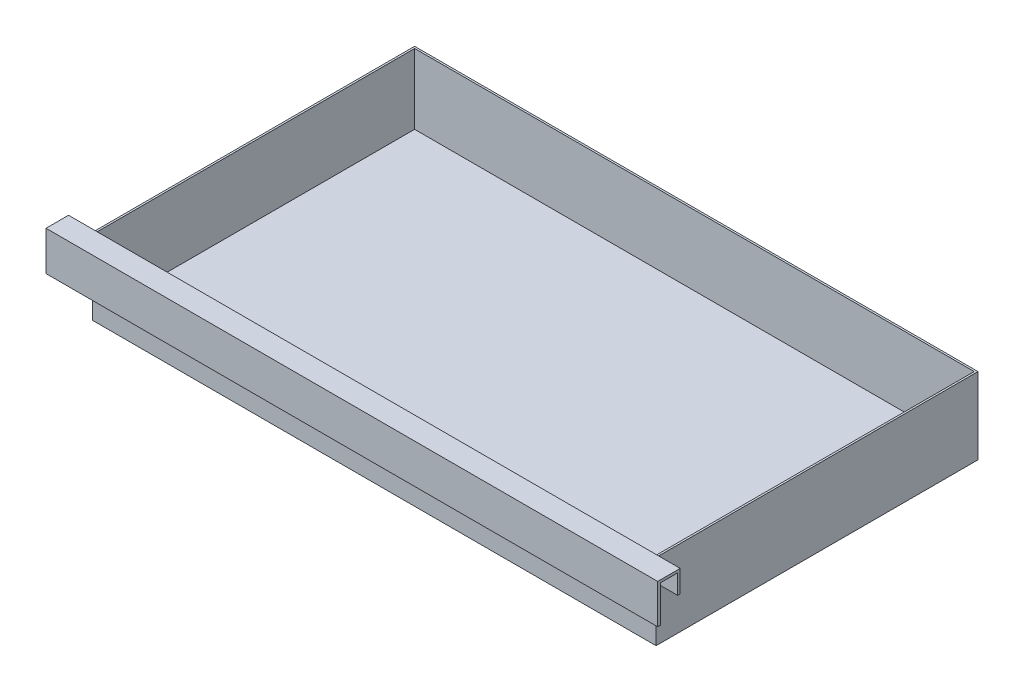
ISO-10303-21;
HEADER;
FILE_DESCRIPTION(('STEP AP214'),'2;1');
FILE_NAME('part.step','',(''),(''),'','','');
FILE_SCHEMA(('AUTOMOTIVE_DESIGN { 1 0 10303 214 1 1 1 1 }'));
ENDSEC;
DATA;
#1=APPLICATION_CONTEXT('core data for automotive mechanical design processes');
#2=APPLICATION_PROTOCOL_DEFINITION('international standard','automotive_design',2000,#1);
#3=PRODUCT_CONTEXT('',#1,'mechanical');
#4=PRODUCT('Part','Part','',(#3));
#5=PRODUCT_RELATED_PRODUCT_CATEGORY('part','',(#4));
#6=PRODUCT_DEFINITION_FORMATION('','',#4);
#7=PRODUCT_DEFINITION_CONTEXT('part definition',#1,'design');
#8=PRODUCT_DEFINITION('design','',#6,#7);
#9=PRODUCT_DEFINITION_SHAPE('','',#8);
#10=(LENGTH_UNIT() NAMED_UNIT(*) SI_UNIT(.MILLI.,.METRE.));
#11=(NAMED_UNIT(*) PLANE_ANGLE_UNIT() SI_UNIT($,.RADIAN.));
#12=(NAMED_UNIT(*) SI_UNIT($,.STERADIAN.) SOLID_ANGLE_UNIT());
#13=UNCERTAINTY_MEASURE_WITH_UNIT(LENGTH_MEASURE(1.E-05),#10,'distance_accuracy_value','');
#14=(GEOMETRIC_REPRESENTATION_CONTEXT(3) GLOBAL_UNCERTAINTY_ASSIGNED_CONTEXT((#13)) GLOBAL_UNIT_ASSIGNED_CONTEXT((#10,
#11,#12)) REPRESENTATION_CONTEXT('',''));
#15=CARTESIAN_POINT('',(0.,0.,0.));
#16=DIRECTION('',(0.,0.,1.));
#17=DIRECTION('',(1.,0.,0.));
#18=AXIS2_PLACEMENT_3D('',#15,#16,#17);
#19=CARTESIAN_POINT('',(0.,2.54,0.));
#20=DIRECTION('',(0.,0.,-1.));
#21=DIRECTION('',(-1.,0.,0.));
#22=AXIS2_PLACEMENT_3D('',#19,#20,#21);
#23=PLANE('',#22);
#24=DIRECTION('',(1.,0.,0.));
#25=VECTOR('',#24,1.);
#26=CARTESIAN_POINT('',(-120.65,22.4754146021905,0.));
#27=LINE('',#26,#25);
#28=CARTESIAN_POINT('',(-111.125,22.4754146021905,0.));
#29=VERTEX_POINT('',#28);
#30=CARTESIAN_POINT('',(111.125,22.4754146021905,0.));
#31=VERTEX_POINT('',#30);
#32=EDGE_CURVE('E11',#29,#31,#27,.T.);
#33=ORIENTED_EDGE('',*,*,#32,.F.);
#34=DIRECTION('',(0.,-1.,0.));
#35=VECTOR('',#34,1.);
#36=CARTESIAN_POINT('',(-111.125,2.54,0.));
#37=LINE('',#36,#35);
#38=CARTESIAN_POINT('',(-111.125,0.,0.));
#39=VERTEX_POINT('',#38);
#40=EDGE_CURVE('E292',#29,#39,#37,.T.);
#41=ORIENTED_EDGE('',*,*,#40,.T.);
#42=DIRECTION('',(1.,0.,0.));
#43=VECTOR('',#42,1.);
#44=CARTESIAN_POINT('',(0.,0.,0.));
#45=LINE('',#44,#43);
#46=CARTESIAN_POINT('',(111.125,0.,0.));
#47=VERTEX_POINT('',#46);
#48=EDGE_CURVE('E282',#39,#47,#45,.T.);
#49=ORIENTED_EDGE('',*,*,#48,.T.);
#50=DIRECTION('',(0.,-1.,0.));
#51=VECTOR('',#50,1.);
#52=CARTESIAN_POINT('',(111.125,2.54,0.));
#53=LINE('',#52,#51);
#54=EDGE_CURVE('E290',#31,#47,#53,.T.);
#55=ORIENTED_EDGE('',*,*,#54,.F.);
#56=EDGE_LOOP('',(#33,#41,#49,#55));
#57=FACE_BOUND('',#56,.T.);
#58=ADVANCED_FACE('F41',(#57),#23,.F.);
#59=CARTESIAN_POINT('',(0.,2.54,-127.));
#60=DIRECTION('',(0.,0.,1.));
#61=DIRECTION('',(1.,0.,0.));
#62=AXIS2_PLACEMENT_3D('',#59,#60,#61);
#63=PLANE('',#62);
#64=DIRECTION('',(-1.,0.,0.));
#65=VECTOR('',#64,1.);
#66=CARTESIAN_POINT('',(0.,0.,-127.));
#67=LINE('',#66,#65);
#68=CARTESIAN_POINT('',(111.125,0.,-127.));
#69=VERTEX_POINT('',#68);
#70=CARTESIAN_POINT('',(-111.125,0.,-127.));
#71=VERTEX_POINT('',#70);
#72=EDGE_CURVE('E276',#69,#71,#67,.T.);
#73=ORIENTED_EDGE('',*,*,#72,.T.);
#74=DIRECTION('',(0.,-1.,0.));
#75=VECTOR('',#74,1.);
#76=CARTESIAN_POINT('',(-111.125,2.54,-127.));
#77=LINE('',#76,#75);
#78=CARTESIAN_POINT('',(-111.125,30.1625,-127.));
#79=VERTEX_POINT('',#78);
#80=EDGE_CURVE('E45',#79,#71,#77,.T.);
#81=ORIENTED_EDGE('',*,*,#80,.F.);
#82=DIRECTION('',(-1.,0.,0.));
#83=VECTOR('',#82,1.);
#84=CARTESIAN_POINT('',(111.125,30.1625,-127.));
#85=LINE('',#84,#83);
#86=CARTESIAN_POINT('',(111.125,30.1625,-127.));
#87=VERTEX_POINT('',#86);
#88=EDGE_CURVE('E264',#87,#79,#85,.T.);
#89=ORIENTED_EDGE('',*,*,#88,.F.);
#90=DIRECTION('',(0.,-1.,0.));
#91=VECTOR('',#90,1.);
#92=CARTESIAN_POINT('',(111.125,2.54,-127.));
#93=LINE('',#92,#91);
#94=EDGE_CURVE('E287',#87,#69,#93,.T.);
#95=ORIENTED_EDGE('',*,*,#94,.T.);
#96=EDGE_LOOP('',(#73,#81,#89,#95));
#97=FACE_BOUND('',#96,.T.);
#98=ADVANCED_FACE('F43',(#97),#63,.F.);
#99=CARTESIAN_POINT('',(-111.125,2.54,0.));
#100=DIRECTION('',(1.,0.,0.));
#101=DIRECTION('',(0.,0.,-1.));
#102=AXIS2_PLACEMENT_3D('',#99,#100,#101);
#103=PLANE('',#102);
#104=DIRECTION('',(0.,0.,1.));
#105=VECTOR('',#104,1.);
#106=CARTESIAN_POINT('',(-111.125,0.,0.));
#107=LINE('',#106,#105);
#108=EDGE_CURVE('E279',#71,#39,#107,.T.);
#109=ORIENTED_EDGE('',*,*,#108,.T.);
#110=ORIENTED_EDGE('',*,*,#40,.F.);
#111=CARTESIAN_POINT('',(-111.125,30.1625,0.));
#112=VERTEX_POINT('',#111);
#113=EDGE_CURVE('E293',#112,#29,#37,.T.);
#114=ORIENTED_EDGE('',*,*,#113,.F.);
#115=DIRECTION('',(0.,0.,1.));
#116=VECTOR('',#115,1.);
#117=CARTESIAN_POINT('',(-111.125,30.1625,-127.));
#118=LINE('',#117,#116);
#119=EDGE_CURVE('E256',#79,#112,#118,.T.);
#120=ORIENTED_EDGE('',*,*,#119,.F.);
#121=ORIENTED_EDGE('',*,*,#80,.T.);
#122=EDGE_LOOP('',(#109,#110,#114,#120,#121));
#123=FACE_BOUND('',#122,.T.);
#124=ADVANCED_FACE('F300',(#123),#103,.F.);
#125=CARTESIAN_POINT('',(111.125,2.54,0.));
#126=DIRECTION('',(-1.,0.,0.));
#127=DIRECTION('',(0.,0.,1.));
#128=AXIS2_PLACEMENT_3D('',#125,#126,#127);
#129=PLANE('',#128);
#130=DIRECTION('',(0.,0.,-1.));
#131=VECTOR('',#130,1.);
#132=CARTESIAN_POINT('',(111.125,0.,0.));
#133=LINE('',#132,#131);
#134=EDGE_CURVE('E285',#47,#69,#133,.T.);
#135=ORIENTED_EDGE('',*,*,#134,.T.);
#136=ORIENTED_EDGE('',*,*,#94,.F.);
#137=DIRECTION('',(0.,0.,-1.));
#138=VECTOR('',#137,1.);
#139=CARTESIAN_POINT('',(111.125,30.1625,0.));
#140=LINE('',#139,#138);
#141=CARTESIAN_POINT('',(111.125,30.1625,0.));
#142=VERTEX_POINT('',#141);
#143=EDGE_CURVE('E261',#142,#87,#140,.T.);
#144=ORIENTED_EDGE('',*,*,#143,.F.);
#145=EDGE_CURVE('E291',#142,#31,#53,.T.);
#146=ORIENTED_EDGE('',*,*,#145,.T.);
#147=ORIENTED_EDGE('',*,*,#54,.T.);
#148=EDGE_LOOP('',(#135,#136,#144,#146,#147));
#149=FACE_BOUND('',#148,.T.);
#150=ADVANCED_FACE('F306',(#149),#129,.F.);
#151=CARTESIAN_POINT('',(0.,0.,0.));
#152=DIRECTION('',(0.,1.,0.));
#153=DIRECTION('',(0.,0.,1.));
#154=AXIS2_PLACEMENT_3D('',#151,#152,#153);
#155=PLANE('',#154);
#156=ORIENTED_EDGE('',*,*,#72,.F.);
#157=ORIENTED_EDGE('',*,*,#134,.F.);
#158=ORIENTED_EDGE('',*,*,#48,.F.);
#159=ORIENTED_EDGE('',*,*,#108,.F.);
#160=EDGE_LOOP('',(#156,#157,#158,#159));
#161=FACE_BOUND('',#160,.T.);
#162=ADVANCED_FACE('F304',(#161),#155,.F.);
#163=CARTESIAN_POINT('',(0.,30.1625,0.));
#164=DIRECTION('',(0.,1.,0.));
#165=DIRECTION('',(0.,0.,1.));
#166=AXIS2_PLACEMENT_3D('',#163,#164,#165);
#167=PLANE('',#166);
#168=ORIENTED_EDGE('',*,*,#119,.T.);
#169=DIRECTION('',(1.,0.,0.));
#170=VECTOR('',#169,1.);
#171=CARTESIAN_POINT('',(-111.125,30.1625,0.));
#172=LINE('',#171,#170);
#173=EDGE_CURVE('E259',#112,#142,#172,.T.);
#174=ORIENTED_EDGE('',*,*,#173,.T.);
#175=ORIENTED_EDGE('',*,*,#143,.T.);
#176=ORIENTED_EDGE('',*,*,#88,.T.);
#177=EDGE_LOOP('',(#168,#174,#175,#176));
#178=FACE_BOUND('',#177,.T.);
#179=DIRECTION('',(0.,0.,1.));
#180=VECTOR('',#179,1.);
#181=CARTESIAN_POINT('',(-110.3757,30.1625,-126.2507));
#182=LINE('',#181,#180);
#183=CARTESIAN_POINT('',(-110.3757,30.1625,-126.2507));
#184=VERTEX_POINT('',#183);
#185=CARTESIAN_POINT('',(-110.3757,30.1625,-0.7493));
#186=VERTEX_POINT('',#185);
#187=EDGE_CURVE('E237',#184,#186,#182,.T.);
#188=ORIENTED_EDGE('',*,*,#187,.F.);
#189=DIRECTION('',(-1.,0.,0.));
#190=VECTOR('',#189,1.);
#191=CARTESIAN_POINT('',(110.3757,30.1625,-126.2507));
#192=LINE('',#191,#190);
#193=CARTESIAN_POINT('',(110.3757,30.1625,-126.2507));
#194=VERTEX_POINT('',#193);
#195=EDGE_CURVE('E224',#194,#184,#192,.T.);
#196=ORIENTED_EDGE('',*,*,#195,.F.);
#197=DIRECTION('',(0.,0.,-1.));
#198=VECTOR('',#197,1.);
#199=CARTESIAN_POINT('',(110.3757,30.1625,-0.7493));
#200=LINE('',#199,#198);
#201=CARTESIAN_POINT('',(110.3757,30.1625,-0.7493));
#202=VERTEX_POINT('',#201);
#203=EDGE_CURVE('E242',#202,#194,#200,.T.);
#204=ORIENTED_EDGE('',*,*,#203,.F.);
#205=DIRECTION('',(1.,0.,0.));
#206=VECTOR('',#205,1.);
#207=CARTESIAN_POINT('',(-110.3757,30.1625,-0.7493));
#208=LINE('',#207,#206);
#209=EDGE_CURVE('E239',#186,#202,#208,.T.);
#210=ORIENTED_EDGE('',*,*,#209,.F.);
#211=EDGE_LOOP('',(#188,#196,#204,#210));
#212=FACE_BOUND('',#211,.T.);
#213=ADVANCED_FACE('F311',(#178,#212),#167,.T.);
#214=CARTESIAN_POINT('',(110.3757,30.1625,-126.2507));
#215=DIRECTION('',(0.,0.,1.));
#216=DIRECTION('',(1.,0.,0.));
#217=AXIS2_PLACEMENT_3D('',#214,#215,#216);
#218=PLANE('',#217);
#219=DIRECTION('',(0.,-1.,0.));
#220=VECTOR('',#219,1.);
#221=CARTESIAN_POINT('',(-110.3757,30.1625,-126.2507));
#222=LINE('',#221,#220);
#223=CARTESIAN_POINT('',(-110.3757,2.54,-126.2507));
#224=VERTEX_POINT('',#223);
#225=EDGE_CURVE('E253',#184,#224,#222,.T.);
#226=ORIENTED_EDGE('',*,*,#225,.T.);
#227=DIRECTION('',(1.,0.,0.));
#228=VECTOR('',#227,1.);
#229=CARTESIAN_POINT('',(0.,2.54,-126.2507));
#230=LINE('',#229,#228);
#231=CARTESIAN_POINT('',(110.3757,2.54,-126.2507));
#232=VERTEX_POINT('',#231);
#233=EDGE_CURVE('E65',#224,#232,#230,.T.);
#234=ORIENTED_EDGE('',*,*,#233,.T.);
#235=DIRECTION('',(0.,-1.,0.));
#236=VECTOR('',#235,1.);
#237=CARTESIAN_POINT('',(110.3757,30.1625,-126.2507));
#238=LINE('',#237,#236);
#239=EDGE_CURVE('E244',#194,#232,#238,.T.);
#240=ORIENTED_EDGE('',*,*,#239,.F.);
#241=ORIENTED_EDGE('',*,*,#195,.T.);
#242=EDGE_LOOP('',(#226,#234,#240,#241));
#243=FACE_BOUND('',#242,.T.);
#244=ADVANCED_FACE('F314',(#243),#218,.T.);
#245=CARTESIAN_POINT('',(-110.3757,30.1625,-126.2507));
#246=DIRECTION('',(1.,0.,0.));
#247=DIRECTION('',(0.,0.,-1.));
#248=AXIS2_PLACEMENT_3D('',#245,#246,#247);
#249=PLANE('',#248);
#250=DIRECTION('',(0.,-1.,0.));
#251=VECTOR('',#250,1.);
#252=CARTESIAN_POINT('',(-110.3757,30.1625,-0.7493));
#253=LINE('',#252,#251);
#254=CARTESIAN_POINT('',(-110.3757,2.54,-0.7493));
#255=VERTEX_POINT('',#254);
#256=EDGE_CURVE('E250',#186,#255,#253,.T.);
#257=ORIENTED_EDGE('',*,*,#256,.T.);
#258=DIRECTION('',(0.,0.,-1.));
#259=VECTOR('',#258,1.);
#260=CARTESIAN_POINT('',(-110.3757,2.54,0.));
#261=LINE('',#260,#259);
#262=EDGE_CURVE('E273',#255,#224,#261,.T.);
#263=ORIENTED_EDGE('',*,*,#262,.T.);
#264=ORIENTED_EDGE('',*,*,#225,.F.);
#265=ORIENTED_EDGE('',*,*,#187,.T.);
#266=EDGE_LOOP('',(#257,#263,#264,#265));
#267=FACE_BOUND('',#266,.T.);
#268=ADVANCED_FACE('F323',(#267),#249,.T.);
#269=CARTESIAN_POINT('',(-110.3757,30.1625,-0.7493));
#270=DIRECTION('',(0.,0.,-1.));
#271=DIRECTION('',(-1.,0.,0.));
#272=AXIS2_PLACEMENT_3D('',#269,#270,#271);
#273=PLANE('',#272);
#274=DIRECTION('',(0.,-1.,0.));
#275=VECTOR('',#274,1.);
#276=CARTESIAN_POINT('',(110.3757,30.1625,-0.7493));
#277=LINE('',#276,#275);
#278=CARTESIAN_POINT('',(110.3757,2.54000000000001,-0.7493));
#279=VERTEX_POINT('',#278);
#280=EDGE_CURVE('E247',#202,#279,#277,.T.);
#281=ORIENTED_EDGE('',*,*,#280,.T.);
#282=DIRECTION('',(-1.,0.,0.));
#283=VECTOR('',#282,1.);
#284=CARTESIAN_POINT('',(0.,2.54,-0.7493));
#285=LINE('',#284,#283);
#286=EDGE_CURVE('E270',#279,#255,#285,.T.);
#287=ORIENTED_EDGE('',*,*,#286,.T.);
#288=ORIENTED_EDGE('',*,*,#256,.F.);
#289=ORIENTED_EDGE('',*,*,#209,.T.);
#290=EDGE_LOOP('',(#281,#287,#288,#289));
#291=FACE_BOUND('',#290,.T.);
#292=ADVANCED_FACE('F325',(#291),#273,.T.);
#293=CARTESIAN_POINT('',(110.3757,30.1625,-0.7493));
#294=DIRECTION('',(-1.,0.,0.));
#295=DIRECTION('',(0.,0.,1.));
#296=AXIS2_PLACEMENT_3D('',#293,#294,#295);
#297=PLANE('',#296);
#298=ORIENTED_EDGE('',*,*,#239,.T.);
#299=DIRECTION('',(0.,0.,1.));
#300=VECTOR('',#299,1.);
#301=CARTESIAN_POINT('',(110.3757,2.54,0.));
#302=LINE('',#301,#300);
#303=EDGE_CURVE('E267',#232,#279,#302,.T.);
#304=ORIENTED_EDGE('',*,*,#303,.T.);
#305=ORIENTED_EDGE('',*,*,#280,.F.);
#306=ORIENTED_EDGE('',*,*,#203,.T.);
#307=EDGE_LOOP('',(#298,#304,#305,#306));
#308=FACE_BOUND('',#307,.T.);
#309=ADVANCED_FACE('F328',(#308),#297,.T.);
#310=CARTESIAN_POINT('',(0.,2.54,0.));
#311=DIRECTION('',(0.,1.,0.));
#312=DIRECTION('',(0.,0.,1.));
#313=AXIS2_PLACEMENT_3D('',#310,#311,#312);
#314=PLANE('',#313);
#315=ORIENTED_EDGE('',*,*,#233,.F.);
#316=ORIENTED_EDGE('',*,*,#262,.F.);
#317=ORIENTED_EDGE('',*,*,#286,.F.);
#318=ORIENTED_EDGE('',*,*,#303,.F.);
#319=EDGE_LOOP('',(#315,#316,#317,#318));
#320=FACE_BOUND('',#319,.T.);
#321=ADVANCED_FACE('F326',(#320),#314,.T.);
#322=CARTESIAN_POINT('',(-120.65,22.4754146021905,0.));
#323=DIRECTION('',(0.,0.,-1.));
#324=DIRECTION('',(-1.,0.,0.));
#325=AXIS2_PLACEMENT_3D('',#322,#323,#324);
#326=PLANE('',#325);
#327=ORIENTED_EDGE('',*,*,#145,.F.);
#328=ORIENTED_EDGE('',*,*,#173,.F.);
#329=ORIENTED_EDGE('',*,*,#113,.T.);
#330=CARTESIAN_POINT('',(-120.65,22.4754146021905,0.));
#331=VERTEX_POINT('',#330);
#332=EDGE_CURVE('E51',#331,#29,#27,.T.);
#333=ORIENTED_EDGE('',*,*,#332,.F.);
#334=DIRECTION('',(0.,1.,0.));
#335=VECTOR('',#334,1.);
#336=CARTESIAN_POINT('',(-120.65,22.4754146021905,0.));
#337=LINE('',#336,#335);
#338=CARTESIAN_POINT('',(-120.65,31.1785,0.));
#339=VERTEX_POINT('',#338);
#340=EDGE_CURVE('E203',#331,#339,#337,.T.);
#341=ORIENTED_EDGE('',*,*,#340,.T.);
#342=DIRECTION('',(1.,0.,0.));
#343=VECTOR('',#342,1.);
#344=CARTESIAN_POINT('',(-120.65,31.1785,0.));
#345=LINE('',#344,#343);
#346=CARTESIAN_POINT('',(120.65,31.1785,0.));
#347=VERTEX_POINT('',#346);
#348=EDGE_CURVE('E174',#339,#347,#345,.T.);
#349=ORIENTED_EDGE('',*,*,#348,.T.);
#350=DIRECTION('',(0.,1.,0.));
#351=VECTOR('',#350,1.);
#352=CARTESIAN_POINT('',(120.65,22.4754146021905,0.));
#353=LINE('',#352,#351);
#354=CARTESIAN_POINT('',(120.65,22.4754146021905,0.));
#355=VERTEX_POINT('',#354);
#356=EDGE_CURVE('E171',#355,#347,#353,.T.);
#357=ORIENTED_EDGE('',*,*,#356,.F.);
#358=EDGE_CURVE('E52',#31,#355,#27,.T.);
#359=ORIENTED_EDGE('',*,*,#358,.F.);
#360=EDGE_LOOP('',(#327,#328,#329,#333,#341,#349,#357,#359));
#361=FACE_BOUND('',#360,.T.);
#362=ADVANCED_FACE('F172',(#361),#326,.T.);
#363=CARTESIAN_POINT('',(-120.65,22.4754146021905,1.016));
#364=DIRECTION('',(0.,-1.,0.));
#365=DIRECTION('',(0.,0.,-1.));
#366=AXIS2_PLACEMENT_3D('',#363,#364,#365);
#367=PLANE('',#366);
#368=ORIENTED_EDGE('',*,*,#332,.T.);
#369=ORIENTED_EDGE('',*,*,#32,.T.);
#370=ORIENTED_EDGE('',*,*,#358,.T.);
#371=DIRECTION('',(0.,0.,-1.));
#372=VECTOR('',#371,1.);
#373=CARTESIAN_POINT('',(120.65,22.4754146021905,1.016));
#374=LINE('',#373,#372);
#375=CARTESIAN_POINT('',(120.65,22.4754146021905,1.016));
#376=VERTEX_POINT('',#375);
#377=EDGE_CURVE('E166',#376,#355,#374,.T.);
#378=ORIENTED_EDGE('',*,*,#377,.F.);
#379=DIRECTION('',(1.,0.,0.));
#380=VECTOR('',#379,1.);
#381=CARTESIAN_POINT('',(-120.65,22.4754146021905,1.016));
#382=LINE('',#381,#380);
#383=CARTESIAN_POINT('',(-120.65,22.4754146021905,1.016));
#384=VERTEX_POINT('',#383);
#385=EDGE_CURVE('E222',#384,#376,#382,.T.);
#386=ORIENTED_EDGE('',*,*,#385,.F.);
#387=DIRECTION('',(0.,0.,-1.));
#388=VECTOR('',#387,1.);
#389=CARTESIAN_POINT('',(-120.65,22.4754146021905,1.016));
#390=LINE('',#389,#388);
#391=EDGE_CURVE('E200',#384,#331,#390,.T.);
#392=ORIENTED_EDGE('',*,*,#391,.T.);
#393=EDGE_LOOP('',(#368,#369,#370,#378,#386,#392));
#394=FACE_BOUND('',#393,.T.);
#395=ADVANCED_FACE('F164',(#394),#367,.T.);
#396=CARTESIAN_POINT('',(-120.65,22.4754146021905,1.016));
#397=DIRECTION('',(0.,0.,1.));
#398=DIRECTION('',(1.,0.,0.));
#399=AXIS2_PLACEMENT_3D('',#396,#397,#398);
#400=PLANE('',#399);
#401=ORIENTED_EDGE('',*,*,#385,.T.);
#402=DIRECTION('',(0.,-1.,0.));
#403=VECTOR('',#402,1.);
#404=CARTESIAN_POINT('',(120.65,22.4754146021905,1.016));
#405=LINE('',#404,#403);
#406=CARTESIAN_POINT('',(120.65,30.1625,1.016));
#407=VERTEX_POINT('',#406);
#408=EDGE_CURVE('E184',#407,#376,#405,.T.);
#409=ORIENTED_EDGE('',*,*,#408,.F.);
#410=DIRECTION('',(1.,0.,0.));
#411=VECTOR('',#410,1.);
#412=CARTESIAN_POINT('',(-120.65,30.1625,1.016));
#413=LINE('',#412,#411);
#414=CARTESIAN_POINT('',(-120.65,30.1625,1.016));
#415=VERTEX_POINT('',#414);
#416=EDGE_CURVE('E225',#415,#407,#413,.T.);
#417=ORIENTED_EDGE('',*,*,#416,.F.);
#418=DIRECTION('',(0.,-1.,0.));
#419=VECTOR('',#418,1.);
#420=CARTESIAN_POINT('',(-120.65,22.4754146021905,1.016));
#421=LINE('',#420,#419);
#422=EDGE_CURVE('E169',#415,#384,#421,.T.);
#423=ORIENTED_EDGE('',*,*,#422,.T.);
#424=EDGE_LOOP('',(#401,#409,#417,#423));
#425=FACE_BOUND('',#424,.T.);
#426=ADVANCED_FACE('F367',(#425),#400,.T.);
#427=CARTESIAN_POINT('',(-120.65,30.1625,1.016));
#428=DIRECTION('',(0.,-1.,0.));
#429=DIRECTION('',(0.,0.,-1.));
#430=AXIS2_PLACEMENT_3D('',#427,#428,#429);
#431=PLANE('',#430);
#432=ORIENTED_EDGE('',*,*,#416,.T.);
#433=DIRECTION('',(0.,0.,-1.));
#434=VECTOR('',#433,1.);
#435=CARTESIAN_POINT('',(120.65,30.1625,1.016));
#436=LINE('',#435,#434);
#437=CARTESIAN_POINT('',(120.65,30.1625,7.874));
#438=VERTEX_POINT('',#437);
#439=EDGE_CURVE('E197',#438,#407,#436,.T.);
#440=ORIENTED_EDGE('',*,*,#439,.F.);
#441=DIRECTION('',(1.,0.,0.));
#442=VECTOR('',#441,1.);
#443=CARTESIAN_POINT('',(-120.65,30.1625,7.874));
#444=LINE('',#443,#442);
#445=CARTESIAN_POINT('',(-120.65,30.1625,7.874));
#446=VERTEX_POINT('',#445);
#447=EDGE_CURVE('E227',#446,#438,#444,.T.);
#448=ORIENTED_EDGE('',*,*,#447,.F.);
#449=DIRECTION('',(0.,0.,-1.));
#450=VECTOR('',#449,1.);
#451=CARTESIAN_POINT('',(-120.65,30.1625,1.016));
#452=LINE('',#451,#450);
#453=EDGE_CURVE('E217',#446,#415,#452,.T.);
#454=ORIENTED_EDGE('',*,*,#453,.T.);
#455=EDGE_LOOP('',(#432,#440,#448,#454));
#456=FACE_BOUND('',#455,.T.);
#457=ADVANCED_FACE('F385',(#456),#431,.T.);
#458=CARTESIAN_POINT('',(-120.65,30.1625,7.874));
#459=DIRECTION('',(0.,0.,-1.));
#460=DIRECTION('',(0.,1.,0.));
#461=AXIS2_PLACEMENT_3D('',#458,#459,#460);
#462=PLANE('',#461);
#463=ORIENTED_EDGE('',*,*,#447,.T.);
#464=DIRECTION('',(0.,1.,0.));
#465=VECTOR('',#464,1.);
#466=CARTESIAN_POINT('',(120.65,30.1625,7.874));
#467=LINE('',#466,#465);
#468=CARTESIAN_POINT('',(120.65,15.6845,7.874));
#469=VERTEX_POINT('',#468);
#470=EDGE_CURVE('E194',#469,#438,#467,.T.);
#471=ORIENTED_EDGE('',*,*,#470,.F.);
#472=DIRECTION('',(1.,0.,0.));
#473=VECTOR('',#472,1.);
#474=CARTESIAN_POINT('',(-120.65,15.6845,7.874));
#475=LINE('',#474,#473);
#476=CARTESIAN_POINT('',(-120.65,15.6845,7.874));
#477=VERTEX_POINT('',#476);
#478=EDGE_CURVE('E229',#477,#469,#475,.T.);
#479=ORIENTED_EDGE('',*,*,#478,.F.);
#480=DIRECTION('',(0.,1.,0.));
#481=VECTOR('',#480,1.);
#482=CARTESIAN_POINT('',(-120.65,30.1625,7.874));
#483=LINE('',#482,#481);
#484=EDGE_CURVE('E214',#477,#446,#483,.T.);
#485=ORIENTED_EDGE('',*,*,#484,.T.);
#486=EDGE_LOOP('',(#463,#471,#479,#485));
#487=FACE_BOUND('',#486,.T.);
#488=ADVANCED_FACE('F381',(#487),#462,.T.);
#489=CARTESIAN_POINT('',(-120.65,15.6845,8.89));
#490=DIRECTION('',(0.,-1.,0.));
#491=DIRECTION('',(0.,0.,-1.));
#492=AXIS2_PLACEMENT_3D('',#489,#490,#491);
#493=PLANE('',#492);
#494=ORIENTED_EDGE('',*,*,#478,.T.);
#495=DIRECTION('',(0.,0.,-1.));
#496=VECTOR('',#495,1.);
#497=CARTESIAN_POINT('',(120.65,15.6845,8.89));
#498=LINE('',#497,#496);
#499=CARTESIAN_POINT('',(120.65,15.6845,8.89));
#500=VERTEX_POINT('',#499);
#501=EDGE_CURVE('E191',#500,#469,#498,.T.);
#502=ORIENTED_EDGE('',*,*,#501,.F.);
#503=DIRECTION('',(1.,0.,0.));
#504=VECTOR('',#503,1.);
#505=CARTESIAN_POINT('',(-120.65,15.6845,8.89));
#506=LINE('',#505,#504);
#507=CARTESIAN_POINT('',(-120.65,15.6845,8.89));
#508=VERTEX_POINT('',#507);
#509=EDGE_CURVE('E231',#508,#500,#506,.T.);
#510=ORIENTED_EDGE('',*,*,#509,.F.);
#511=DIRECTION('',(0.,0.,-1.));
#512=VECTOR('',#511,1.);
#513=CARTESIAN_POINT('',(-120.65,15.6845,8.89));
#514=LINE('',#513,#512);
#515=EDGE_CURVE('E211',#508,#477,#514,.T.);
#516=ORIENTED_EDGE('',*,*,#515,.T.);
#517=EDGE_LOOP('',(#494,#502,#510,#516));
#518=FACE_BOUND('',#517,.T.);
#519=ADVANCED_FACE('F377',(#518),#493,.T.);
#520=CARTESIAN_POINT('',(-120.65,31.1785,8.89));
#521=DIRECTION('',(0.,0.,1.));
#522=DIRECTION('',(0.,-1.,0.));
#523=AXIS2_PLACEMENT_3D('',#520,#521,#522);
#524=PLANE('',#523);
#525=ORIENTED_EDGE('',*,*,#509,.T.);
#526=DIRECTION('',(0.,-1.,0.));
#527=VECTOR('',#526,1.);
#528=CARTESIAN_POINT('',(120.65,31.1785,8.89));
#529=LINE('',#528,#527);
#530=CARTESIAN_POINT('',(120.65,31.1785,8.89));
#531=VERTEX_POINT('',#530);
#532=EDGE_CURVE('E188',#531,#500,#529,.T.);
#533=ORIENTED_EDGE('',*,*,#532,.F.);
#534=DIRECTION('',(1.,0.,0.));
#535=VECTOR('',#534,1.);
#536=CARTESIAN_POINT('',(-120.65,31.1785,8.89));
#537=LINE('',#536,#535);
#538=CARTESIAN_POINT('',(-120.65,31.1785,8.89));
#539=VERTEX_POINT('',#538);
#540=EDGE_CURVE('E233',#539,#531,#537,.T.);
#541=ORIENTED_EDGE('',*,*,#540,.F.);
#542=DIRECTION('',(0.,-1.,0.));
#543=VECTOR('',#542,1.);
#544=CARTESIAN_POINT('',(-120.65,31.1785,8.89));
#545=LINE('',#544,#543);
#546=EDGE_CURVE('E208',#539,#508,#545,.T.);
#547=ORIENTED_EDGE('',*,*,#546,.T.);
#548=EDGE_LOOP('',(#525,#533,#541,#547));
#549=FACE_BOUND('',#548,.T.);
#550=ADVANCED_FACE('F373',(#549),#524,.T.);
#551=CARTESIAN_POINT('',(-120.65,31.1785,0.));
#552=DIRECTION('',(0.,1.,0.));
#553=DIRECTION('',(0.,0.,1.));
#554=AXIS2_PLACEMENT_3D('',#551,#552,#553);
#555=PLANE('',#554);
#556=ORIENTED_EDGE('',*,*,#540,.T.);
#557=DIRECTION('',(0.,0.,1.));
#558=VECTOR('',#557,1.);
#559=CARTESIAN_POINT('',(120.65,31.1785,0.));
#560=LINE('',#559,#558);
#561=EDGE_CURVE('E178',#347,#531,#560,.T.);
#562=ORIENTED_EDGE('',*,*,#561,.F.);
#563=ORIENTED_EDGE('',*,*,#348,.F.);
#564=DIRECTION('',(0.,0.,1.));
#565=VECTOR('',#564,1.);
#566=CARTESIAN_POINT('',(-120.65,31.1785,0.));
#567=LINE('',#566,#565);
#568=EDGE_CURVE('E205',#339,#539,#567,.T.);
#569=ORIENTED_EDGE('',*,*,#568,.T.);
#570=EDGE_LOOP('',(#556,#562,#563,#569));
#571=FACE_BOUND('',#570,.T.);
#572=ADVANCED_FACE('F369',(#571),#555,.T.);
#573=CARTESIAN_POINT('',(-120.65,0.,0.));
#574=DIRECTION('',(1.,0.,0.));
#575=DIRECTION('',(0.,0.,-1.));
#576=AXIS2_PLACEMENT_3D('',#573,#574,#575);
#577=PLANE('',#576);
#578=ORIENTED_EDGE('',*,*,#391,.F.);
#579=ORIENTED_EDGE('',*,*,#422,.F.);
#580=ORIENTED_EDGE('',*,*,#453,.F.);
#581=ORIENTED_EDGE('',*,*,#484,.F.);
#582=ORIENTED_EDGE('',*,*,#515,.F.);
#583=ORIENTED_EDGE('',*,*,#546,.F.);
#584=ORIENTED_EDGE('',*,*,#568,.F.);
#585=ORIENTED_EDGE('',*,*,#340,.F.);
#586=EDGE_LOOP('',(#578,#579,#580,#581,#582,#583,#584,#585));
#587=FACE_BOUND('',#586,.T.);
#588=ADVANCED_FACE('F372',(#587),#577,.F.);
#589=CARTESIAN_POINT('',(120.65,0.,0.));
#590=DIRECTION('',(1.,0.,0.));
#591=DIRECTION('',(0.,0.,-1.));
#592=AXIS2_PLACEMENT_3D('',#589,#590,#591);
#593=PLANE('',#592);
#594=ORIENTED_EDGE('',*,*,#377,.T.);
#595=ORIENTED_EDGE('',*,*,#356,.T.);
#596=ORIENTED_EDGE('',*,*,#561,.T.);
#597=ORIENTED_EDGE('',*,*,#532,.T.);
#598=ORIENTED_EDGE('',*,*,#501,.T.);
#599=ORIENTED_EDGE('',*,*,#470,.T.);
#600=ORIENTED_EDGE('',*,*,#439,.T.);
#601=ORIENTED_EDGE('',*,*,#408,.T.);
#602=EDGE_LOOP('',(#594,#595,#596,#597,#598,#599,#600,#601));
#603=FACE_BOUND('',#602,.T.);
#604=ADVANCED_FACE('F181',(#603),#593,.T.);
#605=CLOSED_SHELL('',(#58,#98,#124,#150,#162,#213,#244,#268,#292,#309,#321,#362,#395,#426,#457,
#488,#519,#550,#572,#588,#604));
#606=MANIFOLD_SOLID_BREP('B2',#605);
#607=ADVANCED_BREP_SHAPE_REPRESENTATION('',(#18,#606),#14);
#608=SHAPE_DEFINITION_REPRESENTATION(#9,#607);
ENDSEC;
END-ISO-10303-21;
